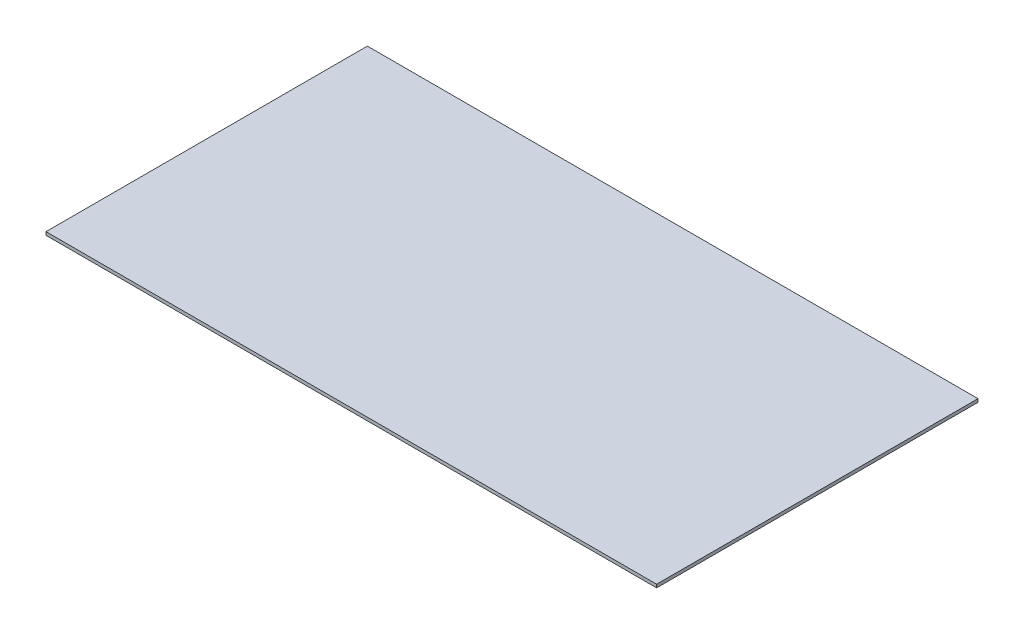
ISO-10303-21;
HEADER;
FILE_DESCRIPTION(('STEP AP214'),'2;1');
FILE_NAME('part.step','',(''),(''),'','','');
FILE_SCHEMA(('AUTOMOTIVE_DESIGN { 1 0 10303 214 1 1 1 1 }'));
ENDSEC;
DATA;
#1=APPLICATION_CONTEXT('core data for automotive mechanical design processes');
#2=APPLICATION_PROTOCOL_DEFINITION('international standard','automotive_design',2000,#1);
#3=PRODUCT_CONTEXT('',#1,'mechanical');
#4=PRODUCT('Part','Part','',(#3));
#5=PRODUCT_RELATED_PRODUCT_CATEGORY('part','',(#4));
#6=PRODUCT_DEFINITION_FORMATION('','',#4);
#7=PRODUCT_DEFINITION_CONTEXT('part definition',#1,'design');
#8=PRODUCT_DEFINITION('design','',#6,#7);
#9=PRODUCT_DEFINITION_SHAPE('','',#8);
#10=(LENGTH_UNIT() NAMED_UNIT(*) SI_UNIT(.MILLI.,.METRE.));
#11=(NAMED_UNIT(*) PLANE_ANGLE_UNIT() SI_UNIT($,.RADIAN.));
#12=(NAMED_UNIT(*) SI_UNIT($,.STERADIAN.) SOLID_ANGLE_UNIT());
#13=UNCERTAINTY_MEASURE_WITH_UNIT(LENGTH_MEASURE(1.E-05),#10,'distance_accuracy_value','');
#14=(GEOMETRIC_REPRESENTATION_CONTEXT(3) GLOBAL_UNCERTAINTY_ASSIGNED_CONTEXT((#13)) GLOBAL_UNIT_ASSIGNED_CONTEXT((#10,
#11,#12)) REPRESENTATION_CONTEXT('',''));
#15=CARTESIAN_POINT('',(0.,0.,0.));
#16=DIRECTION('',(0.,0.,1.));
#17=DIRECTION('',(1.,0.,0.));
#18=AXIS2_PLACEMENT_3D('',#15,#16,#17);
#19=CARTESIAN_POINT('',(190.,2.,-100.));
#20=DIRECTION('',(-1.,0.,0.));
#21=DIRECTION('',(0.,0.,1.));
#22=AXIS2_PLACEMENT_3D('',#19,#20,#21);
#23=PLANE('',#22);
#24=DIRECTION('',(0.,0.,-1.));
#25=VECTOR('',#24,1.);
#26=CARTESIAN_POINT('',(190.,0.,-100.));
#27=LINE('',#26,#25);
#28=CARTESIAN_POINT('',(190.,0.,100.));
#29=VERTEX_POINT('',#28);
#30=CARTESIAN_POINT('',(190.,0.,-100.));
#31=VERTEX_POINT('',#30);
#32=EDGE_CURVE('E97',#29,#31,#27,.T.);
#33=ORIENTED_EDGE('',*,*,#32,.T.);
#34=DIRECTION('',(0.,-1.,0.));
#35=VECTOR('',#34,1.);
#36=CARTESIAN_POINT('',(190.,2.,-100.));
#37=LINE('',#36,#35);
#38=CARTESIAN_POINT('',(190.,2.,-100.));
#39=VERTEX_POINT('',#38);
#40=EDGE_CURVE('E11',#39,#31,#37,.T.);
#41=ORIENTED_EDGE('',*,*,#40,.F.);
#42=DIRECTION('',(0.,0.,-1.));
#43=VECTOR('',#42,1.);
#44=CARTESIAN_POINT('',(190.,2.,-100.));
#45=LINE('',#44,#43);
#46=CARTESIAN_POINT('',(190.,2.,100.));
#47=VERTEX_POINT('',#46);
#48=EDGE_CURVE('E85',#47,#39,#45,.T.);
#49=ORIENTED_EDGE('',*,*,#48,.F.);
#50=DIRECTION('',(0.,-1.,0.));
#51=VECTOR('',#50,1.);
#52=CARTESIAN_POINT('',(190.,2.,100.));
#53=LINE('',#52,#51);
#54=EDGE_CURVE('E93',#47,#29,#53,.T.);
#55=ORIENTED_EDGE('',*,*,#54,.T.);
#56=EDGE_LOOP('',(#33,#41,#49,#55));
#57=FACE_BOUND('',#56,.T.);
#58=ADVANCED_FACE('F34',(#57),#23,.F.);
#59=CARTESIAN_POINT('',(-190.,2.,-100.));
#60=DIRECTION('',(0.,0.,1.));
#61=DIRECTION('',(1.,0.,0.));
#62=AXIS2_PLACEMENT_3D('',#59,#60,#61);
#63=PLANE('',#62);
#64=DIRECTION('',(-1.,0.,0.));
#65=VECTOR('',#64,1.);
#66=CARTESIAN_POINT('',(-190.,0.,-100.));
#67=LINE('',#66,#65);
#68=CARTESIAN_POINT('',(-190.,0.,-100.));
#69=VERTEX_POINT('',#68);
#70=EDGE_CURVE('E89',#31,#69,#67,.T.);
#71=ORIENTED_EDGE('',*,*,#70,.T.);
#72=DIRECTION('',(0.,-1.,0.));
#73=VECTOR('',#72,1.);
#74=CARTESIAN_POINT('',(-190.,2.,-100.));
#75=LINE('',#74,#73);
#76=CARTESIAN_POINT('',(-190.,2.,-100.));
#77=VERTEX_POINT('',#76);
#78=EDGE_CURVE('E42',#77,#69,#75,.T.);
#79=ORIENTED_EDGE('',*,*,#78,.F.);
#80=DIRECTION('',(-1.,0.,0.));
#81=VECTOR('',#80,1.);
#82=CARTESIAN_POINT('',(-190.,2.,-100.));
#83=LINE('',#82,#81);
#84=EDGE_CURVE('E80',#39,#77,#83,.T.);
#85=ORIENTED_EDGE('',*,*,#84,.F.);
#86=ORIENTED_EDGE('',*,*,#40,.T.);
#87=EDGE_LOOP('',(#71,#79,#85,#86));
#88=FACE_BOUND('',#87,.T.);
#89=ADVANCED_FACE('F88',(#88),#63,.F.);
#90=CARTESIAN_POINT('',(-190.,2.,-100.));
#91=DIRECTION('',(1.,0.,0.));
#92=DIRECTION('',(0.,0.,-1.));
#93=AXIS2_PLACEMENT_3D('',#90,#91,#92);
#94=PLANE('',#93);
#95=DIRECTION('',(0.,0.,1.));
#96=VECTOR('',#95,1.);
#97=CARTESIAN_POINT('',(-190.,0.,-100.));
#98=LINE('',#97,#96);
#99=CARTESIAN_POINT('',(-190.,0.,100.));
#100=VERTEX_POINT('',#99);
#101=EDGE_CURVE('E67',#69,#100,#98,.T.);
#102=ORIENTED_EDGE('',*,*,#101,.T.);
#103=DIRECTION('',(0.,-1.,0.));
#104=VECTOR('',#103,1.);
#105=CARTESIAN_POINT('',(-190.,2.,100.));
#106=LINE('',#105,#104);
#107=CARTESIAN_POINT('',(-190.,2.,100.));
#108=VERTEX_POINT('',#107);
#109=EDGE_CURVE('E90',#108,#100,#106,.T.);
#110=ORIENTED_EDGE('',*,*,#109,.F.);
#111=DIRECTION('',(0.,0.,1.));
#112=VECTOR('',#111,1.);
#113=CARTESIAN_POINT('',(-190.,2.,-100.));
#114=LINE('',#113,#112);
#115=EDGE_CURVE('E83',#77,#108,#114,.T.);
#116=ORIENTED_EDGE('',*,*,#115,.F.);
#117=ORIENTED_EDGE('',*,*,#78,.T.);
#118=EDGE_LOOP('',(#102,#110,#116,#117));
#119=FACE_BOUND('',#118,.T.);
#120=ADVANCED_FACE('F91',(#119),#94,.F.);
#121=CARTESIAN_POINT('',(-190.,2.,100.));
#122=DIRECTION('',(0.,0.,-1.));
#123=DIRECTION('',(-1.,0.,0.));
#124=AXIS2_PLACEMENT_3D('',#121,#122,#123);
#125=PLANE('',#124);
#126=DIRECTION('',(1.,0.,0.));
#127=VECTOR('',#126,1.);
#128=CARTESIAN_POINT('',(-190.,0.,100.));
#129=LINE('',#128,#127);
#130=EDGE_CURVE('E73',#100,#29,#129,.T.);
#131=ORIENTED_EDGE('',*,*,#130,.T.);
#132=ORIENTED_EDGE('',*,*,#54,.F.);
#133=DIRECTION('',(1.,0.,0.));
#134=VECTOR('',#133,1.);
#135=CARTESIAN_POINT('',(-190.,2.,100.));
#136=LINE('',#135,#134);
#137=EDGE_CURVE('E50',#108,#47,#136,.T.);
#138=ORIENTED_EDGE('',*,*,#137,.F.);
#139=ORIENTED_EDGE('',*,*,#109,.T.);
#140=EDGE_LOOP('',(#131,#132,#138,#139));
#141=FACE_BOUND('',#140,.T.);
#142=ADVANCED_FACE('F104',(#141),#125,.F.);
#143=CARTESIAN_POINT('',(0.,2.,0.));
#144=DIRECTION('',(0.,1.,0.));
#145=DIRECTION('',(0.,0.,1.));
#146=AXIS2_PLACEMENT_3D('',#143,#144,#145);
#147=PLANE('',#146);
#148=ORIENTED_EDGE('',*,*,#48,.T.);
#149=ORIENTED_EDGE('',*,*,#84,.T.);
#150=ORIENTED_EDGE('',*,*,#115,.T.);
#151=ORIENTED_EDGE('',*,*,#137,.T.);
#152=EDGE_LOOP('',(#148,#149,#150,#151));
#153=FACE_BOUND('',#152,.T.);
#154=ADVANCED_FACE('F81',(#153),#147,.T.);
#155=CARTESIAN_POINT('',(0.,0.,0.));
#156=DIRECTION('',(0.,1.,0.));
#157=DIRECTION('',(0.,0.,1.));
#158=AXIS2_PLACEMENT_3D('',#155,#156,#157);
#159=PLANE('',#158);
#160=ORIENTED_EDGE('',*,*,#32,.F.);
#161=ORIENTED_EDGE('',*,*,#130,.F.);
#162=ORIENTED_EDGE('',*,*,#101,.F.);
#163=ORIENTED_EDGE('',*,*,#70,.F.);
#164=EDGE_LOOP('',(#160,#161,#162,#163));
#165=FACE_BOUND('',#164,.T.);
#166=ADVANCED_FACE('F107',(#165),#159,.F.);
#167=CLOSED_SHELL('',(#58,#89,#120,#142,#154,#166));
#168=MANIFOLD_SOLID_BREP('B2',#167);
#169=ADVANCED_BREP_SHAPE_REPRESENTATION('',(#18,#168),#14);
#170=SHAPE_DEFINITION_REPRESENTATION(#9,#169);
ENDSEC;
END-ISO-10303-21;
